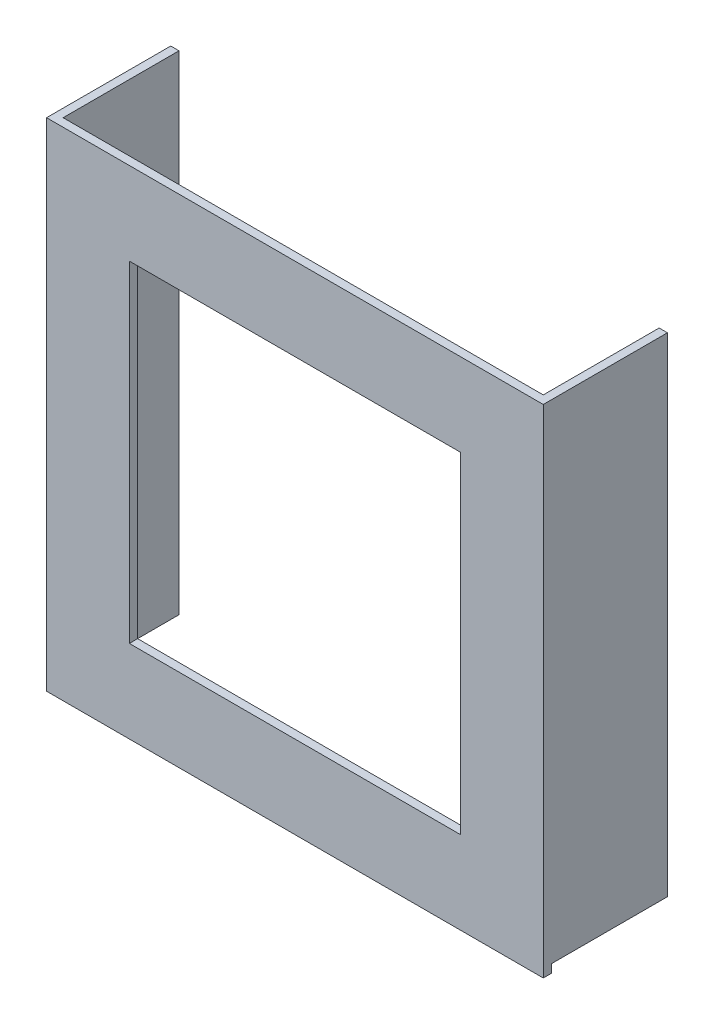
ISO-10303-21;
HEADER;
FILE_DESCRIPTION(('STEP AP214'),'2;1');
FILE_NAME('part.step','',(''),(''),'','','');
FILE_SCHEMA(('AUTOMOTIVE_DESIGN { 1 0 10303 214 1 1 1 1 }'));
ENDSEC;
DATA;
#1=APPLICATION_CONTEXT('core data for automotive mechanical design processes');
#2=APPLICATION_PROTOCOL_DEFINITION('international standard','automotive_design',2000,#1);
#3=PRODUCT_CONTEXT('',#1,'mechanical');
#4=PRODUCT('Part','Part','',(#3));
#5=PRODUCT_RELATED_PRODUCT_CATEGORY('part','',(#4));
#6=PRODUCT_DEFINITION_FORMATION('','',#4);
#7=PRODUCT_DEFINITION_CONTEXT('part definition',#1,'design');
#8=PRODUCT_DEFINITION('design','',#6,#7);
#9=PRODUCT_DEFINITION_SHAPE('','',#8);
#10=(LENGTH_UNIT() NAMED_UNIT(*) SI_UNIT(.MILLI.,.METRE.));
#11=(NAMED_UNIT(*) PLANE_ANGLE_UNIT() SI_UNIT($,.RADIAN.));
#12=(NAMED_UNIT(*) SI_UNIT($,.STERADIAN.) SOLID_ANGLE_UNIT());
#13=UNCERTAINTY_MEASURE_WITH_UNIT(LENGTH_MEASURE(1.E-05),#10,'distance_accuracy_value','');
#14=(GEOMETRIC_REPRESENTATION_CONTEXT(3) GLOBAL_UNCERTAINTY_ASSIGNED_CONTEXT((#13)) GLOBAL_UNIT_ASSIGNED_CONTEXT((#10,
#11,#12)) REPRESENTATION_CONTEXT('',''));
#15=CARTESIAN_POINT('',(0.,0.,0.));
#16=DIRECTION('',(0.,0.,1.));
#17=DIRECTION('',(1.,0.,0.));
#18=AXIS2_PLACEMENT_3D('',#15,#16,#17);
#19=CARTESIAN_POINT('',(0.,0.,5.));
#20=DIRECTION('',(0.,0.,1.));
#21=DIRECTION('',(1.,0.,0.));
#22=AXIS2_PLACEMENT_3D('',#19,#20,#21);
#23=PLANE('',#22);
#24=DIRECTION('',(0.,1.,0.));
#25=VECTOR('',#24,1.);
#26=CARTESIAN_POINT('',(150.,150.,5.));
#27=LINE('',#26,#25);
#28=CARTESIAN_POINT('',(150.,-150.,5.));
#29=VERTEX_POINT('',#28);
#30=CARTESIAN_POINT('',(150.,150.,5.));
#31=VERTEX_POINT('',#30);
#32=EDGE_CURVE('E220',#29,#31,#27,.T.);
#33=ORIENTED_EDGE('',*,*,#32,.T.);
#34=DIRECTION('',(-1.,0.,0.));
#35=VECTOR('',#34,1.);
#36=CARTESIAN_POINT('',(-150.,150.,5.));
#37=LINE('',#36,#35);
#38=CARTESIAN_POINT('',(-150.,150.,5.));
#39=VERTEX_POINT('',#38);
#40=EDGE_CURVE('E223',#31,#39,#37,.T.);
#41=ORIENTED_EDGE('',*,*,#40,.T.);
#42=DIRECTION('',(0.,-1.,0.));
#43=VECTOR('',#42,1.);
#44=CARTESIAN_POINT('',(-150.,150.,5.));
#45=LINE('',#44,#43);
#46=CARTESIAN_POINT('',(-150.,-150.,5.));
#47=VERTEX_POINT('',#46);
#48=EDGE_CURVE('E226',#39,#47,#45,.T.);
#49=ORIENTED_EDGE('',*,*,#48,.T.);
#50=DIRECTION('',(1.,0.,0.));
#51=VECTOR('',#50,1.);
#52=CARTESIAN_POINT('',(-150.,-150.,5.));
#53=LINE('',#52,#51);
#54=EDGE_CURVE('E228',#47,#29,#53,.T.);
#55=ORIENTED_EDGE('',*,*,#54,.T.);
#56=EDGE_LOOP('',(#33,#41,#49,#55));
#57=FACE_BOUND('',#56,.T.);
#58=DIRECTION('',(-1.,0.,0.));
#59=VECTOR('',#58,1.);
#60=CARTESIAN_POINT('',(-100.,99.9999999999999,5.));
#61=LINE('',#60,#59);
#62=CARTESIAN_POINT('',(100.,99.9999999999999,5.));
#63=VERTEX_POINT('',#62);
#64=CARTESIAN_POINT('',(-100.,99.9999999999999,5.));
#65=VERTEX_POINT('',#64);
#66=EDGE_CURVE('E191',#63,#65,#61,.T.);
#67=ORIENTED_EDGE('',*,*,#66,.F.);
#68=DIRECTION('',(0.,1.,0.));
#69=VECTOR('',#68,1.);
#70=CARTESIAN_POINT('',(100.,99.9999999999999,5.));
#71=LINE('',#70,#69);
#72=CARTESIAN_POINT('',(100.,-100.,5.));
#73=VERTEX_POINT('',#72);
#74=EDGE_CURVE('E189',#73,#63,#71,.T.);
#75=ORIENTED_EDGE('',*,*,#74,.F.);
#76=DIRECTION('',(1.,0.,0.));
#77=VECTOR('',#76,1.);
#78=CARTESIAN_POINT('',(-100.,-100.,5.));
#79=LINE('',#78,#77);
#80=CARTESIAN_POINT('',(-100.,-100.,5.));
#81=VERTEX_POINT('',#80);
#82=EDGE_CURVE('E197',#81,#73,#79,.T.);
#83=ORIENTED_EDGE('',*,*,#82,.F.);
#84=DIRECTION('',(0.,-1.,0.));
#85=VECTOR('',#84,1.);
#86=CARTESIAN_POINT('',(-100.,99.9999999999999,5.));
#87=LINE('',#86,#85);
#88=EDGE_CURVE('E194',#65,#81,#87,.T.);
#89=ORIENTED_EDGE('',*,*,#88,.F.);
#90=EDGE_LOOP('',(#67,#75,#83,#89));
#91=FACE_BOUND('',#90,.T.);
#92=ADVANCED_FACE('F35',(#57,#91),#23,.T.);
#93=CARTESIAN_POINT('',(0.,0.,0.));
#94=DIRECTION('',(0.,0.,1.));
#95=DIRECTION('',(1.,0.,0.));
#96=AXIS2_PLACEMENT_3D('',#93,#94,#95);
#97=PLANE('',#96);
#98=DIRECTION('',(-1.,0.,0.));
#99=VECTOR('',#98,1.);
#100=CARTESIAN_POINT('',(-8.04911692853238E-13,-145.000000000001,0.));
#101=LINE('',#100,#99);
#102=CARTESIAN_POINT('',(-145.,-145.,0.));
#103=VERTEX_POINT('',#102);
#104=CARTESIAN_POINT('',(-150.,-145.,0.));
#105=VERTEX_POINT('',#104);
#106=EDGE_CURVE('E159',#103,#105,#101,.T.);
#107=ORIENTED_EDGE('',*,*,#106,.F.);
#108=DIRECTION('',(0.,1.,0.));
#109=VECTOR('',#108,1.);
#110=CARTESIAN_POINT('',(-144.999999999999,-8.0491169285322E-13,0.));
#111=LINE('',#110,#109);
#112=CARTESIAN_POINT('',(-145.,150.,0.));
#113=VERTEX_POINT('',#112);
#114=EDGE_CURVE('E144',#103,#113,#111,.T.);
#115=ORIENTED_EDGE('',*,*,#114,.T.);
#116=DIRECTION('',(-1.,0.,0.));
#117=VECTOR('',#116,1.);
#118=CARTESIAN_POINT('',(-150.,150.,0.));
#119=LINE('',#118,#117);
#120=CARTESIAN_POINT('',(145.,150.,0.));
#121=VERTEX_POINT('',#120);
#122=EDGE_CURVE('E233',#121,#113,#119,.T.);
#123=ORIENTED_EDGE('',*,*,#122,.F.);
#124=DIRECTION('',(0.,-1.,0.));
#125=VECTOR('',#124,1.);
#126=CARTESIAN_POINT('',(145.,0.,0.));
#127=LINE('',#126,#125);
#128=CARTESIAN_POINT('',(145.,-145.,0.));
#129=VERTEX_POINT('',#128);
#130=EDGE_CURVE('E147',#121,#129,#127,.T.);
#131=ORIENTED_EDGE('',*,*,#130,.T.);
#132=DIRECTION('',(1.,0.,0.));
#133=VECTOR('',#132,1.);
#134=CARTESIAN_POINT('',(8.04911692853238E-13,-145.000000000001,0.));
#135=LINE('',#134,#133);
#136=CARTESIAN_POINT('',(150.,-145.,0.));
#137=VERTEX_POINT('',#136);
#138=EDGE_CURVE('E173',#129,#137,#135,.T.);
#139=ORIENTED_EDGE('',*,*,#138,.T.);
#140=DIRECTION('',(0.,1.,0.));
#141=VECTOR('',#140,1.);
#142=CARTESIAN_POINT('',(150.,150.,0.));
#143=LINE('',#142,#141);
#144=CARTESIAN_POINT('',(150.,-150.,0.));
#145=VERTEX_POINT('',#144);
#146=EDGE_CURVE('E219',#145,#137,#143,.T.);
#147=ORIENTED_EDGE('',*,*,#146,.F.);
#148=DIRECTION('',(1.,0.,0.));
#149=VECTOR('',#148,1.);
#150=CARTESIAN_POINT('',(-150.,-150.,0.));
#151=LINE('',#150,#149);
#152=CARTESIAN_POINT('',(-150.,-150.,0.));
#153=VERTEX_POINT('',#152);
#154=EDGE_CURVE('E224',#153,#145,#151,.T.);
#155=ORIENTED_EDGE('',*,*,#154,.F.);
#156=DIRECTION('',(0.,-1.,0.));
#157=VECTOR('',#156,1.);
#158=CARTESIAN_POINT('',(-150.,150.,0.));
#159=LINE('',#158,#157);
#160=EDGE_CURVE('E236',#105,#153,#159,.T.);
#161=ORIENTED_EDGE('',*,*,#160,.F.);
#162=EDGE_LOOP('',(#107,#115,#123,#131,#139,#147,#155,#161));
#163=FACE_BOUND('',#162,.T.);
#164=DIRECTION('',(0.,1.,0.));
#165=VECTOR('',#164,1.);
#166=CARTESIAN_POINT('',(100.,99.9999999999999,0.));
#167=LINE('',#166,#165);
#168=CARTESIAN_POINT('',(100.,-100.,0.));
#169=VERTEX_POINT('',#168);
#170=CARTESIAN_POINT('',(100.,99.9999999999999,0.));
#171=VERTEX_POINT('',#170);
#172=EDGE_CURVE('E188',#169,#171,#167,.T.);
#173=ORIENTED_EDGE('',*,*,#172,.T.);
#174=DIRECTION('',(-1.,0.,0.));
#175=VECTOR('',#174,1.);
#176=CARTESIAN_POINT('',(-100.,99.9999999999999,0.));
#177=LINE('',#176,#175);
#178=CARTESIAN_POINT('',(-100.,99.9999999999999,0.));
#179=VERTEX_POINT('',#178);
#180=EDGE_CURVE('E202',#171,#179,#177,.T.);
#181=ORIENTED_EDGE('',*,*,#180,.T.);
#182=DIRECTION('',(0.,-1.,0.));
#183=VECTOR('',#182,1.);
#184=CARTESIAN_POINT('',(-100.,99.9999999999999,0.));
#185=LINE('',#184,#183);
#186=CARTESIAN_POINT('',(-100.,-100.,0.));
#187=VERTEX_POINT('',#186);
#188=EDGE_CURVE('E205',#179,#187,#185,.T.);
#189=ORIENTED_EDGE('',*,*,#188,.T.);
#190=DIRECTION('',(1.,0.,0.));
#191=VECTOR('',#190,1.);
#192=CARTESIAN_POINT('',(-100.,-100.,0.));
#193=LINE('',#192,#191);
#194=EDGE_CURVE('E192',#187,#169,#193,.T.);
#195=ORIENTED_EDGE('',*,*,#194,.T.);
#196=EDGE_LOOP('',(#173,#181,#189,#195));
#197=FACE_BOUND('',#196,.T.);
#198=ADVANCED_FACE('F251',(#163,#197),#97,.F.);
#199=CARTESIAN_POINT('',(150.,150.,5.));
#200=DIRECTION('',(-1.,0.,0.));
#201=DIRECTION('',(0.,-1.,0.));
#202=AXIS2_PLACEMENT_3D('',#199,#200,#201);
#203=PLANE('',#202);
#204=ORIENTED_EDGE('',*,*,#146,.T.);
#205=DIRECTION('',(0.,0.,1.));
#206=VECTOR('',#205,1.);
#207=CARTESIAN_POINT('',(150.,-145.,-70.));
#208=LINE('',#207,#206);
#209=CARTESIAN_POINT('',(150.,-145.,-70.));
#210=VERTEX_POINT('',#209);
#211=EDGE_CURVE('E58',#210,#137,#208,.T.);
#212=ORIENTED_EDGE('',*,*,#211,.F.);
#213=DIRECTION('',(0.,-1.,0.));
#214=VECTOR('',#213,1.);
#215=CARTESIAN_POINT('',(150.,0.,-70.));
#216=LINE('',#215,#214);
#217=CARTESIAN_POINT('',(150.,150.,-70.));
#218=VERTEX_POINT('',#217);
#219=EDGE_CURVE('E176',#218,#210,#216,.T.);
#220=ORIENTED_EDGE('',*,*,#219,.F.);
#221=DIRECTION('',(0.,0.,-1.));
#222=VECTOR('',#221,1.);
#223=CARTESIAN_POINT('',(150.,150.,5.));
#224=LINE('',#223,#222);
#225=EDGE_CURVE('E11',#31,#218,#224,.T.);
#226=ORIENTED_EDGE('',*,*,#225,.F.);
#227=ORIENTED_EDGE('',*,*,#32,.F.);
#228=DIRECTION('',(0.,0.,-1.));
#229=VECTOR('',#228,1.);
#230=CARTESIAN_POINT('',(150.,-150.,5.));
#231=LINE('',#230,#229);
#232=EDGE_CURVE('E230',#29,#145,#231,.T.);
#233=ORIENTED_EDGE('',*,*,#232,.T.);
#234=EDGE_LOOP('',(#204,#212,#220,#226,#227,#233));
#235=FACE_BOUND('',#234,.T.);
#236=ADVANCED_FACE('F37',(#235),#203,.F.);
#237=CARTESIAN_POINT('',(-150.,150.,5.));
#238=DIRECTION('',(0.,-1.,0.));
#239=DIRECTION('',(0.,0.,-1.));
#240=AXIS2_PLACEMENT_3D('',#237,#238,#239);
#241=PLANE('',#240);
#242=ORIENTED_EDGE('',*,*,#225,.T.);
#243=DIRECTION('',(1.,0.,0.));
#244=VECTOR('',#243,1.);
#245=CARTESIAN_POINT('',(0.,150.,-70.));
#246=LINE('',#245,#244);
#247=CARTESIAN_POINT('',(145.,150.,-70.));
#248=VERTEX_POINT('',#247);
#249=EDGE_CURVE('E172',#248,#218,#246,.T.);
#250=ORIENTED_EDGE('',*,*,#249,.F.);
#251=DIRECTION('',(0.,0.,1.));
#252=VECTOR('',#251,1.);
#253=CARTESIAN_POINT('',(145.,150.,-70.));
#254=LINE('',#253,#252);
#255=EDGE_CURVE('E186',#248,#121,#254,.T.);
#256=ORIENTED_EDGE('',*,*,#255,.T.);
#257=ORIENTED_EDGE('',*,*,#122,.T.);
#258=DIRECTION('',(0.,0.,1.));
#259=VECTOR('',#258,1.);
#260=CARTESIAN_POINT('',(-145.,150.,-70.));
#261=LINE('',#260,#259);
#262=CARTESIAN_POINT('',(-145.,150.,-70.));
#263=VERTEX_POINT('',#262);
#264=EDGE_CURVE('E165',#263,#113,#261,.T.);
#265=ORIENTED_EDGE('',*,*,#264,.F.);
#266=DIRECTION('',(1.,0.,0.));
#267=VECTOR('',#266,1.);
#268=CARTESIAN_POINT('',(0.,150.,-70.));
#269=LINE('',#268,#267);
#270=CARTESIAN_POINT('',(-150.,150.,-70.));
#271=VERTEX_POINT('',#270);
#272=EDGE_CURVE('E157',#271,#263,#269,.T.);
#273=ORIENTED_EDGE('',*,*,#272,.F.);
#274=DIRECTION('',(0.,0.,-1.));
#275=VECTOR('',#274,1.);
#276=CARTESIAN_POINT('',(-150.,150.,5.));
#277=LINE('',#276,#275);
#278=EDGE_CURVE('E43',#39,#271,#277,.T.);
#279=ORIENTED_EDGE('',*,*,#278,.F.);
#280=ORIENTED_EDGE('',*,*,#40,.F.);
#281=EDGE_LOOP('',(#242,#250,#256,#257,#265,#273,#279,#280));
#282=FACE_BOUND('',#281,.T.);
#283=ADVANCED_FACE('F248',(#282),#241,.F.);
#284=CARTESIAN_POINT('',(-150.,150.,5.));
#285=DIRECTION('',(1.,0.,0.));
#286=DIRECTION('',(0.,1.,0.));
#287=AXIS2_PLACEMENT_3D('',#284,#285,#286);
#288=PLANE('',#287);
#289=ORIENTED_EDGE('',*,*,#278,.T.);
#290=DIRECTION('',(0.,1.,0.));
#291=VECTOR('',#290,1.);
#292=CARTESIAN_POINT('',(-150.,0.,-70.));
#293=LINE('',#292,#291);
#294=CARTESIAN_POINT('',(-150.,-145.,-70.));
#295=VERTEX_POINT('',#294);
#296=EDGE_CURVE('E153',#295,#271,#293,.T.);
#297=ORIENTED_EDGE('',*,*,#296,.F.);
#298=DIRECTION('',(0.,0.,1.));
#299=VECTOR('',#298,1.);
#300=CARTESIAN_POINT('',(-150.,-145.,-70.));
#301=LINE('',#300,#299);
#302=EDGE_CURVE('E50',#295,#105,#301,.T.);
#303=ORIENTED_EDGE('',*,*,#302,.T.);
#304=ORIENTED_EDGE('',*,*,#160,.T.);
#305=DIRECTION('',(0.,0.,-1.));
#306=VECTOR('',#305,1.);
#307=CARTESIAN_POINT('',(-150.,-150.,5.));
#308=LINE('',#307,#306);
#309=EDGE_CURVE('E241',#47,#153,#308,.T.);
#310=ORIENTED_EDGE('',*,*,#309,.F.);
#311=ORIENTED_EDGE('',*,*,#48,.F.);
#312=EDGE_LOOP('',(#289,#297,#303,#304,#310,#311));
#313=FACE_BOUND('',#312,.T.);
#314=ADVANCED_FACE('F245',(#313),#288,.F.);
#315=CARTESIAN_POINT('',(-150.,-150.,5.));
#316=DIRECTION('',(0.,1.,0.));
#317=DIRECTION('',(0.,0.,1.));
#318=AXIS2_PLACEMENT_3D('',#315,#316,#317);
#319=PLANE('',#318);
#320=ORIENTED_EDGE('',*,*,#154,.T.);
#321=ORIENTED_EDGE('',*,*,#232,.F.);
#322=ORIENTED_EDGE('',*,*,#54,.F.);
#323=ORIENTED_EDGE('',*,*,#309,.T.);
#324=EDGE_LOOP('',(#320,#321,#322,#323));
#325=FACE_BOUND('',#324,.T.);
#326=ADVANCED_FACE('F258',(#325),#319,.F.);
#327=CARTESIAN_POINT('',(100.,99.9999999999999,5.));
#328=DIRECTION('',(-1.,0.,0.));
#329=DIRECTION('',(0.,0.,1.));
#330=AXIS2_PLACEMENT_3D('',#327,#328,#329);
#331=PLANE('',#330);
#332=ORIENTED_EDGE('',*,*,#172,.F.);
#333=DIRECTION('',(0.,0.,-1.));
#334=VECTOR('',#333,1.);
#335=CARTESIAN_POINT('',(100.,-100.,5.));
#336=LINE('',#335,#334);
#337=EDGE_CURVE('E199',#73,#169,#336,.T.);
#338=ORIENTED_EDGE('',*,*,#337,.F.);
#339=ORIENTED_EDGE('',*,*,#74,.T.);
#340=DIRECTION('',(0.,0.,-1.));
#341=VECTOR('',#340,1.);
#342=CARTESIAN_POINT('',(100.,99.9999999999999,5.));
#343=LINE('',#342,#341);
#344=EDGE_CURVE('E216',#63,#171,#343,.T.);
#345=ORIENTED_EDGE('',*,*,#344,.T.);
#346=EDGE_LOOP('',(#332,#338,#339,#345));
#347=FACE_BOUND('',#346,.T.);
#348=ADVANCED_FACE('F293',(#347),#331,.T.);
#349=CARTESIAN_POINT('',(-100.,99.9999999999999,5.));
#350=DIRECTION('',(0.,-1.,0.));
#351=DIRECTION('',(0.,0.,-1.));
#352=AXIS2_PLACEMENT_3D('',#349,#350,#351);
#353=PLANE('',#352);
#354=ORIENTED_EDGE('',*,*,#180,.F.);
#355=ORIENTED_EDGE('',*,*,#344,.F.);
#356=ORIENTED_EDGE('',*,*,#66,.T.);
#357=DIRECTION('',(0.,0.,-1.));
#358=VECTOR('',#357,1.);
#359=CARTESIAN_POINT('',(-100.,99.9999999999999,5.));
#360=LINE('',#359,#358);
#361=EDGE_CURVE('E214',#65,#179,#360,.T.);
#362=ORIENTED_EDGE('',*,*,#361,.T.);
#363=EDGE_LOOP('',(#354,#355,#356,#362));
#364=FACE_BOUND('',#363,.T.);
#365=ADVANCED_FACE('F327',(#364),#353,.T.);
#366=CARTESIAN_POINT('',(-100.,99.9999999999999,5.));
#367=DIRECTION('',(1.,0.,0.));
#368=DIRECTION('',(0.,0.,-1.));
#369=AXIS2_PLACEMENT_3D('',#366,#367,#368);
#370=PLANE('',#369);
#371=ORIENTED_EDGE('',*,*,#188,.F.);
#372=ORIENTED_EDGE('',*,*,#361,.F.);
#373=ORIENTED_EDGE('',*,*,#88,.T.);
#374=DIRECTION('',(0.,0.,-1.));
#375=VECTOR('',#374,1.);
#376=CARTESIAN_POINT('',(-100.,-100.,5.));
#377=LINE('',#376,#375);
#378=EDGE_CURVE('E212',#81,#187,#377,.T.);
#379=ORIENTED_EDGE('',*,*,#378,.T.);
#380=EDGE_LOOP('',(#371,#372,#373,#379));
#381=FACE_BOUND('',#380,.T.);
#382=ADVANCED_FACE('F283',(#381),#370,.T.);
#383=CARTESIAN_POINT('',(-100.,-100.,5.));
#384=DIRECTION('',(0.,1.,0.));
#385=DIRECTION('',(0.,0.,1.));
#386=AXIS2_PLACEMENT_3D('',#383,#384,#385);
#387=PLANE('',#386);
#388=ORIENTED_EDGE('',*,*,#194,.F.);
#389=ORIENTED_EDGE('',*,*,#378,.F.);
#390=ORIENTED_EDGE('',*,*,#82,.T.);
#391=ORIENTED_EDGE('',*,*,#337,.T.);
#392=EDGE_LOOP('',(#388,#389,#390,#391));
#393=FACE_BOUND('',#392,.T.);
#394=ADVANCED_FACE('F276',(#393),#387,.T.);
#395=CARTESIAN_POINT('',(145.,0.,-70.));
#396=DIRECTION('',(-1.,0.,0.));
#397=DIRECTION('',(0.,0.,1.));
#398=AXIS2_PLACEMENT_3D('',#395,#396,#397);
#399=PLANE('',#398);
#400=ORIENTED_EDGE('',*,*,#130,.F.);
#401=ORIENTED_EDGE('',*,*,#255,.F.);
#402=DIRECTION('',(0.,-1.,0.));
#403=VECTOR('',#402,1.);
#404=CARTESIAN_POINT('',(145.,0.,-70.));
#405=LINE('',#404,#403);
#406=CARTESIAN_POINT('',(145.,-145.,-70.));
#407=VERTEX_POINT('',#406);
#408=EDGE_CURVE('E169',#248,#407,#405,.T.);
#409=ORIENTED_EDGE('',*,*,#408,.T.);
#410=DIRECTION('',(0.,0.,1.));
#411=VECTOR('',#410,1.);
#412=CARTESIAN_POINT('',(145.,-145.,-70.));
#413=LINE('',#412,#411);
#414=EDGE_CURVE('E180',#407,#129,#413,.T.);
#415=ORIENTED_EDGE('',*,*,#414,.T.);
#416=EDGE_LOOP('',(#400,#401,#409,#415));
#417=FACE_BOUND('',#416,.T.);
#418=ADVANCED_FACE('F274',(#417),#399,.T.);
#419=CARTESIAN_POINT('',(8.04911692853238E-13,-145.000000000001,-70.));
#420=DIRECTION('',(0.,-1.,0.));
#421=DIRECTION('',(1.,0.,0.));
#422=AXIS2_PLACEMENT_3D('',#419,#420,#421);
#423=PLANE('',#422);
#424=ORIENTED_EDGE('',*,*,#138,.F.);
#425=ORIENTED_EDGE('',*,*,#414,.F.);
#426=DIRECTION('',(1.,0.,0.));
#427=VECTOR('',#426,1.);
#428=CARTESIAN_POINT('',(8.04911692853238E-13,-145.000000000001,-70.));
#429=LINE('',#428,#427);
#430=EDGE_CURVE('E178',#407,#210,#429,.T.);
#431=ORIENTED_EDGE('',*,*,#430,.T.);
#432=ORIENTED_EDGE('',*,*,#211,.T.);
#433=EDGE_LOOP('',(#424,#425,#431,#432));
#434=FACE_BOUND('',#433,.T.);
#435=ADVANCED_FACE('F271',(#434),#423,.T.);
#436=CARTESIAN_POINT('',(0.,0.,-70.));
#437=DIRECTION('',(0.,0.,-1.));
#438=DIRECTION('',(-1.,0.,0.));
#439=AXIS2_PLACEMENT_3D('',#436,#437,#438);
#440=PLANE('',#439);
#441=ORIENTED_EDGE('',*,*,#408,.F.);
#442=ORIENTED_EDGE('',*,*,#249,.T.);
#443=ORIENTED_EDGE('',*,*,#219,.T.);
#444=ORIENTED_EDGE('',*,*,#430,.F.);
#445=EDGE_LOOP('',(#441,#442,#443,#444));
#446=FACE_BOUND('',#445,.T.);
#447=ADVANCED_FACE('F269',(#446),#440,.T.);
#448=CARTESIAN_POINT('',(-144.999999999999,-8.0491169285322E-13,-70.));
#449=DIRECTION('',(1.,0.,0.));
#450=DIRECTION('',(0.,1.,0.));
#451=AXIS2_PLACEMENT_3D('',#448,#449,#450);
#452=PLANE('',#451);
#453=ORIENTED_EDGE('',*,*,#114,.F.);
#454=DIRECTION('',(0.,0.,1.));
#455=VECTOR('',#454,1.);
#456=CARTESIAN_POINT('',(-145.,-145.,-70.));
#457=LINE('',#456,#455);
#458=CARTESIAN_POINT('',(-145.,-145.,-70.));
#459=VERTEX_POINT('',#458);
#460=EDGE_CURVE('E138',#459,#103,#457,.T.);
#461=ORIENTED_EDGE('',*,*,#460,.F.);
#462=DIRECTION('',(0.,1.,0.));
#463=VECTOR('',#462,1.);
#464=CARTESIAN_POINT('',(-144.999999999999,-8.0491169285322E-13,-70.));
#465=LINE('',#464,#463);
#466=EDGE_CURVE('E142',#459,#263,#465,.T.);
#467=ORIENTED_EDGE('',*,*,#466,.T.);
#468=ORIENTED_EDGE('',*,*,#264,.T.);
#469=EDGE_LOOP('',(#453,#461,#467,#468));
#470=FACE_BOUND('',#469,.T.);
#471=ADVANCED_FACE('F140',(#470),#452,.T.);
#472=CARTESIAN_POINT('',(-8.04911692853238E-13,-145.000000000001,-70.));
#473=DIRECTION('',(0.,1.,0.));
#474=DIRECTION('',(-1.,0.,0.));
#475=AXIS2_PLACEMENT_3D('',#472,#473,#474);
#476=PLANE('',#475);
#477=ORIENTED_EDGE('',*,*,#106,.T.);
#478=ORIENTED_EDGE('',*,*,#302,.F.);
#479=DIRECTION('',(-1.,0.,0.));
#480=VECTOR('',#479,1.);
#481=CARTESIAN_POINT('',(-8.04911692853238E-13,-145.000000000001,-70.));
#482=LINE('',#481,#480);
#483=EDGE_CURVE('E149',#459,#295,#482,.T.);
#484=ORIENTED_EDGE('',*,*,#483,.F.);
#485=ORIENTED_EDGE('',*,*,#460,.T.);
#486=EDGE_LOOP('',(#477,#478,#484,#485));
#487=FACE_BOUND('',#486,.T.);
#488=ADVANCED_FACE('F150',(#487),#476,.F.);
#489=CARTESIAN_POINT('',(0.,0.,-70.));
#490=DIRECTION('',(0.,0.,-1.));
#491=DIRECTION('',(-1.,0.,0.));
#492=AXIS2_PLACEMENT_3D('',#489,#490,#491);
#493=PLANE('',#492);
#494=ORIENTED_EDGE('',*,*,#466,.F.);
#495=ORIENTED_EDGE('',*,*,#483,.T.);
#496=ORIENTED_EDGE('',*,*,#296,.T.);
#497=ORIENTED_EDGE('',*,*,#272,.T.);
#498=EDGE_LOOP('',(#494,#495,#496,#497));
#499=FACE_BOUND('',#498,.T.);
#500=ADVANCED_FACE('F155',(#499),#493,.T.);
#501=CLOSED_SHELL('',(#92,#198,#236,#283,#314,#326,#348,#365,#382,#394,#418,#435,#447,#471,#488,#500));
#502=MANIFOLD_SOLID_BREP('B2',#501);
#503=ADVANCED_BREP_SHAPE_REPRESENTATION('',(#18,#502),#14);
#504=SHAPE_DEFINITION_REPRESENTATION(#9,#503);
ENDSEC;
END-ISO-10303-21;
